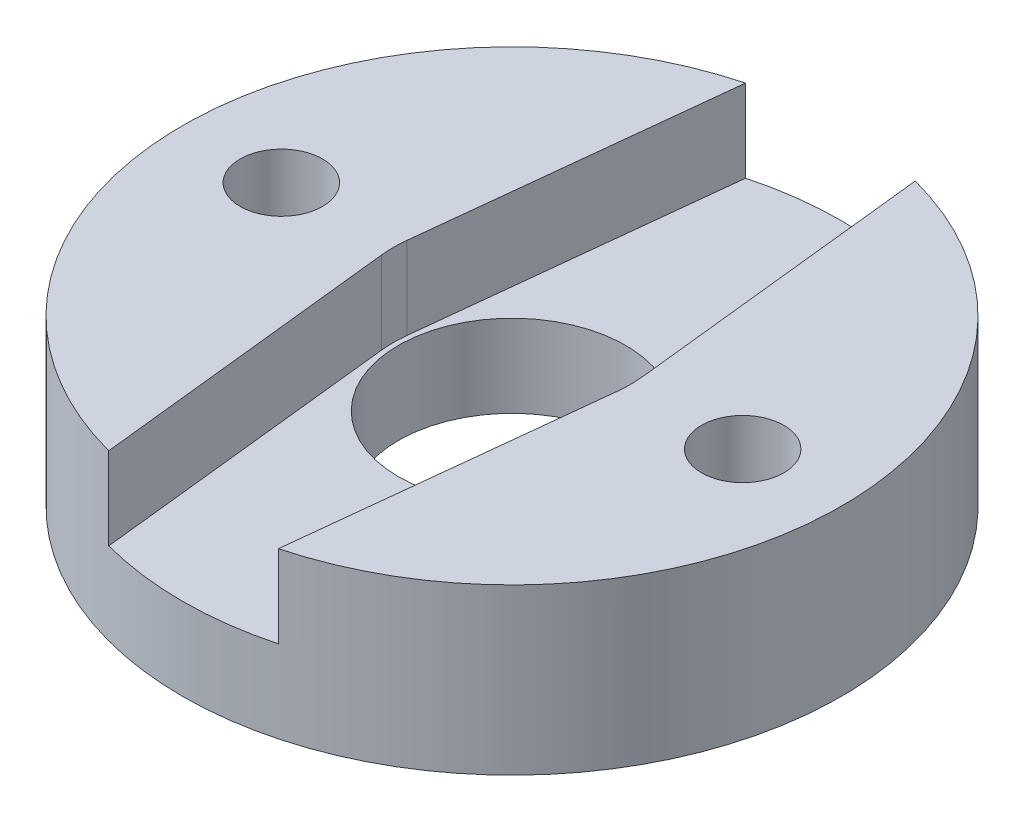
ISO-10303-21;
HEADER;
FILE_DESCRIPTION(('STEP AP214'),'2;1');
FILE_NAME('part.step','',(''),(''),'','','');
FILE_SCHEMA(('AUTOMOTIVE_DESIGN { 1 0 10303 214 1 1 1 1 }'));
ENDSEC;
DATA;
#1=APPLICATION_CONTEXT('core data for automotive mechanical design processes');
#2=APPLICATION_PROTOCOL_DEFINITION('international standard','automotive_design',2000,#1);
#3=PRODUCT_CONTEXT('',#1,'mechanical');
#4=PRODUCT('Part','Part','',(#3));
#5=PRODUCT_RELATED_PRODUCT_CATEGORY('part','',(#4));
#6=PRODUCT_DEFINITION_FORMATION('','',#4);
#7=PRODUCT_DEFINITION_CONTEXT('part definition',#1,'design');
#8=PRODUCT_DEFINITION('design','',#6,#7);
#9=PRODUCT_DEFINITION_SHAPE('','',#8);
#10=(LENGTH_UNIT() NAMED_UNIT(*) SI_UNIT(.MILLI.,.METRE.));
#11=(NAMED_UNIT(*) PLANE_ANGLE_UNIT() SI_UNIT($,.RADIAN.));
#12=(NAMED_UNIT(*) SI_UNIT($,.STERADIAN.) SOLID_ANGLE_UNIT());
#13=UNCERTAINTY_MEASURE_WITH_UNIT(LENGTH_MEASURE(1.E-05),#10,'distance_accuracy_value','');
#14=(GEOMETRIC_REPRESENTATION_CONTEXT(3) GLOBAL_UNCERTAINTY_ASSIGNED_CONTEXT((#13)) GLOBAL_UNIT_ASSIGNED_CONTEXT((#10,
#11,#12)) REPRESENTATION_CONTEXT('',''));
#15=CARTESIAN_POINT('',(0.,0.,0.));
#16=DIRECTION('',(0.,0.,1.));
#17=DIRECTION('',(1.,0.,0.));
#18=AXIS2_PLACEMENT_3D('',#15,#16,#17);
#19=CARTESIAN_POINT('',(0.,5.,0.));
#20=DIRECTION('',(0.,-1.,0.));
#21=DIRECTION('',(0.,0.,-1.));
#22=AXIS2_PLACEMENT_3D('',#19,#20,#21);
#23=CYLINDRICAL_SURFACE('',#22,10.);
#24=CARTESIAN_POINT('',(0.,0.,0.));
#25=DIRECTION('',(0.,1.,0.));
#26=DIRECTION('',(0.,0.,1.));
#27=AXIS2_PLACEMENT_3D('',#24,#25,#26);
#28=CIRCLE('',#27,10.);
#29=CARTESIAN_POINT('',(0.,0.,10.));
#30=VERTEX_POINT('',#29);
#31=EDGE_CURVE('E170',#30,#30,#28,.T.);
#32=ORIENTED_EDGE('',*,*,#31,.T.);
#33=EDGE_LOOP('',(#32));
#34=FACE_BOUND('',#33,.T.);
#35=DIRECTION('',(0.,-1.,0.));
#36=VECTOR('',#35,1.);
#37=CARTESIAN_POINT('',(-2.57381899329224,5.,-9.66309762911294));
#38=LINE('',#37,#36);
#39=CARTESIAN_POINT('',(-2.57381899329224,2.5,-9.66309762911294));
#40=VERTEX_POINT('',#39);
#41=CARTESIAN_POINT('',(-2.57381899329224,5.,-9.66309762911294));
#42=VERTEX_POINT('',#41);
#43=EDGE_CURVE('E149',#40,#42,#38,.F.);
#44=ORIENTED_EDGE('',*,*,#43,.F.);
#45=CARTESIAN_POINT('',(0.,2.5,0.));
#46=DIRECTION('',(0.,1.,0.));
#47=DIRECTION('',(0.,0.,1.));
#48=AXIS2_PLACEMENT_3D('',#45,#46,#47);
#49=CIRCLE('',#48,10.);
#50=CARTESIAN_POINT('',(2.57381899329237,2.5,-9.6630976291129));
#51=VERTEX_POINT('',#50);
#52=EDGE_CURVE('E147',#51,#40,#49,.T.);
#53=ORIENTED_EDGE('',*,*,#52,.F.);
#54=DIRECTION('',(0.,-1.,0.));
#55=VECTOR('',#54,1.);
#56=CARTESIAN_POINT('',(2.57381899329238,5.,-9.6630976291129));
#57=LINE('',#56,#55);
#58=CARTESIAN_POINT('',(2.57381899329237,5.,-9.6630976291129));
#59=VERTEX_POINT('',#58);
#60=EDGE_CURVE('E57',#51,#59,#57,.F.);
#61=ORIENTED_EDGE('',*,*,#60,.T.);
#62=CARTESIAN_POINT('',(0.,5.,0.));
#63=DIRECTION('',(0.,1.,0.));
#64=DIRECTION('',(0.,0.,1.));
#65=AXIS2_PLACEMENT_3D('',#62,#63,#64);
#66=CIRCLE('',#65,10.);
#67=CARTESIAN_POINT('',(2.57381899329231,5.,9.66309762911292));
#68=VERTEX_POINT('',#67);
#69=EDGE_CURVE('E11',#68,#59,#66,.T.);
#70=ORIENTED_EDGE('',*,*,#69,.F.);
#71=DIRECTION('',(0.,-1.,0.));
#72=VECTOR('',#71,1.);
#73=CARTESIAN_POINT('',(2.57381899329231,5.,9.66309762911292));
#74=LINE('',#73,#72);
#75=CARTESIAN_POINT('',(2.57381899329231,2.5,9.66309762911292));
#76=VERTEX_POINT('',#75);
#77=EDGE_CURVE('E154',#76,#68,#74,.F.);
#78=ORIENTED_EDGE('',*,*,#77,.F.);
#79=CARTESIAN_POINT('',(-2.57381899329231,2.5,9.66309762911292));
#80=VERTEX_POINT('',#79);
#81=EDGE_CURVE('E145',#80,#76,#49,.T.);
#82=ORIENTED_EDGE('',*,*,#81,.F.);
#83=DIRECTION('',(0.,-1.,0.));
#84=VECTOR('',#83,1.);
#85=CARTESIAN_POINT('',(-2.57381899329231,5.,9.66309762911292));
#86=LINE('',#85,#84);
#87=CARTESIAN_POINT('',(-2.57381899329231,5.,9.66309762911292));
#88=VERTEX_POINT('',#87);
#89=EDGE_CURVE('E151',#80,#88,#86,.F.);
#90=ORIENTED_EDGE('',*,*,#89,.T.);
#91=EDGE_CURVE('E41',#42,#88,#66,.T.);
#92=ORIENTED_EDGE('',*,*,#91,.F.);
#93=EDGE_LOOP('',(#44,#53,#61,#70,#78,#82,#90,#92));
#94=FACE_BOUND('',#93,.T.);
#95=ADVANCED_FACE('F33',(#34,#94),#23,.T.);
#96=CARTESIAN_POINT('',(0.,5.,0.));
#97=DIRECTION('',(0.,1.,0.));
#98=DIRECTION('',(0.,0.,1.));
#99=AXIS2_PLACEMENT_3D('',#96,#97,#98);
#100=PLANE('',#99);
#101=CARTESIAN_POINT('',(7.,5.,0.));
#102=DIRECTION('',(0.,1.,0.));
#103=DIRECTION('',(0.,0.,1.));
#104=AXIS2_PLACEMENT_3D('',#101,#102,#103);
#105=CIRCLE('',#104,1.25);
#106=CARTESIAN_POINT('',(7.,5.,1.25));
#107=VERTEX_POINT('',#106);
#108=EDGE_CURVE('E165',#107,#107,#105,.T.);
#109=ORIENTED_EDGE('',*,*,#108,.F.);
#110=EDGE_LOOP('',(#109));
#111=FACE_BOUND('',#110,.T.);
#112=CARTESIAN_POINT('',(0.,5.,0.));
#113=DIRECTION('',(0.,1.,0.));
#114=DIRECTION('',(0.,0.,1.));
#115=AXIS2_PLACEMENT_3D('',#112,#113,#114);
#116=CIRCLE('',#115,3.6);
#117=CARTESIAN_POINT('',(3.57904224953043,5.,0.387887323943661));
#118=VERTEX_POINT('',#117);
#119=CARTESIAN_POINT('',(3.57904224953043,5.,-0.387887323943636));
#120=VERTEX_POINT('',#119);
#121=EDGE_CURVE('E49',#118,#120,#116,.T.);
#122=ORIENTED_EDGE('',*,*,#121,.F.);
#123=DIRECTION('',(-0.107746478873239,0.,0.994178402647341));
#124=VECTOR('',#123,1.);
#125=CARTESIAN_POINT('',(3.57904224953043,5.,0.387887323943661));
#126=LINE('',#125,#124);
#127=EDGE_CURVE('E115',#118,#68,#126,.T.);
#128=ORIENTED_EDGE('',*,*,#127,.T.);
#129=ORIENTED_EDGE('',*,*,#69,.T.);
#130=DIRECTION('',(-0.107746478873233,0.,-0.994178402647342));
#131=VECTOR('',#130,1.);
#132=CARTESIAN_POINT('',(3.57904224953043,5.,-0.387887323943636));
#133=LINE('',#132,#131);
#134=EDGE_CURVE('E131',#120,#59,#133,.T.);
#135=ORIENTED_EDGE('',*,*,#134,.F.);
#136=EDGE_LOOP('',(#122,#128,#129,#135));
#137=FACE_BOUND('',#136,.T.);
#138=ADVANCED_FACE('F206',(#111,#137),#100,.T.);
#139=CARTESIAN_POINT('',(0.,5.,0.));
#140=DIRECTION('',(0.,1.,0.));
#141=DIRECTION('',(0.,0.,1.));
#142=AXIS2_PLACEMENT_3D('',#139,#140,#141);
#143=CYLINDRICAL_SURFACE('',#142,3.449999958);
#144=CARTESIAN_POINT('',(0.,0.,0.));
#145=DIRECTION('',(0.,1.,0.));
#146=DIRECTION('',(0.,0.,1.));
#147=AXIS2_PLACEMENT_3D('',#144,#145,#146);
#148=CIRCLE('',#147,3.449999958);
#149=CARTESIAN_POINT('',(0.,0.,3.449999958));
#150=VERTEX_POINT('',#149);
#151=EDGE_CURVE('E156',#150,#150,#148,.T.);
#152=ORIENTED_EDGE('',*,*,#151,.F.);
#153=EDGE_LOOP('',(#152));
#154=FACE_BOUND('',#153,.T.);
#155=CARTESIAN_POINT('',(0.,2.5,0.));
#156=DIRECTION('',(0.,1.,0.));
#157=DIRECTION('',(0.,0.,1.));
#158=AXIS2_PLACEMENT_3D('',#155,#156,#157);
#159=CIRCLE('',#158,3.449999958);
#160=CARTESIAN_POINT('',(0.,2.5,3.449999958));
#161=VERTEX_POINT('',#160);
#162=EDGE_CURVE('E36',#161,#161,#159,.F.);
#163=ORIENTED_EDGE('',*,*,#162,.F.);
#164=EDGE_LOOP('',(#163));
#165=FACE_BOUND('',#164,.T.);
#166=ADVANCED_FACE('F210',(#154,#165),#143,.F.);
#167=DIRECTION('',(0.107746478873239,0.,0.994178402647341));
#168=VECTOR('',#167,1.);
#169=CARTESIAN_POINT('',(-3.57904224953043,5.,0.387887323943661));
#170=LINE('',#169,#168);
#171=CARTESIAN_POINT('',(-3.57904224953043,5.,0.387887323943661));
#172=VERTEX_POINT('',#171);
#173=EDGE_CURVE('E118',#172,#88,#170,.T.);
#174=ORIENTED_EDGE('',*,*,#173,.F.);
#175=CARTESIAN_POINT('',(0.,5.,0.));
#176=DIRECTION('',(0.,1.,0.));
#177=DIRECTION('',(0.,0.,1.));
#178=AXIS2_PLACEMENT_3D('',#175,#176,#177);
#179=CIRCLE('',#178,3.6);
#180=CARTESIAN_POINT('',(-3.57904224953043,5.,-0.387887323943687));
#181=VERTEX_POINT('',#180);
#182=EDGE_CURVE('E136',#181,#172,#179,.T.);
#183=ORIENTED_EDGE('',*,*,#182,.F.);
#184=DIRECTION('',(0.107746478873246,0.,-0.99417840264734));
#185=VECTOR('',#184,1.);
#186=CARTESIAN_POINT('',(-3.57904224953043,5.,-0.387887323943686));
#187=LINE('',#186,#185);
#188=EDGE_CURVE('E133',#181,#42,#187,.T.);
#189=ORIENTED_EDGE('',*,*,#188,.T.);
#190=ORIENTED_EDGE('',*,*,#91,.T.);
#191=EDGE_LOOP('',(#174,#183,#189,#190));
#192=FACE_BOUND('',#191,.T.);
#193=CARTESIAN_POINT('',(-7.,5.,0.));
#194=DIRECTION('',(0.,1.,0.));
#195=DIRECTION('',(0.,0.,1.));
#196=AXIS2_PLACEMENT_3D('',#193,#194,#195);
#197=CIRCLE('',#196,1.25);
#198=CARTESIAN_POINT('',(-7.,5.,1.25));
#199=VERTEX_POINT('',#198);
#200=EDGE_CURVE('E159',#199,#199,#197,.T.);
#201=ORIENTED_EDGE('',*,*,#200,.F.);
#202=EDGE_LOOP('',(#201));
#203=FACE_BOUND('',#202,.T.);
#204=ADVANCED_FACE('F178',(#192,#203),#100,.T.);
#205=CARTESIAN_POINT('',(0.,0.,0.));
#206=DIRECTION('',(0.,1.,0.));
#207=DIRECTION('',(0.,0.,1.));
#208=AXIS2_PLACEMENT_3D('',#205,#206,#207);
#209=PLANE('',#208);
#210=ORIENTED_EDGE('',*,*,#151,.T.);
#211=EDGE_LOOP('',(#210));
#212=FACE_BOUND('',#211,.T.);
#213=CARTESIAN_POINT('',(-7.,0.,0.));
#214=DIRECTION('',(0.,1.,0.));
#215=DIRECTION('',(0.,0.,1.));
#216=AXIS2_PLACEMENT_3D('',#213,#214,#215);
#217=CIRCLE('',#216,1.24999999999999);
#218=CARTESIAN_POINT('',(-7.,0.,1.24999999999999));
#219=VERTEX_POINT('',#218);
#220=EDGE_CURVE('E162',#219,#219,#217,.T.);
#221=ORIENTED_EDGE('',*,*,#220,.T.);
#222=EDGE_LOOP('',(#221));
#223=FACE_BOUND('',#222,.T.);
#224=CARTESIAN_POINT('',(7.,0.,0.));
#225=DIRECTION('',(0.,1.,0.));
#226=DIRECTION('',(0.,0.,1.));
#227=AXIS2_PLACEMENT_3D('',#224,#225,#226);
#228=CIRCLE('',#227,1.24999999999999);
#229=CARTESIAN_POINT('',(7.,0.,1.24999999999999));
#230=VERTEX_POINT('',#229);
#231=EDGE_CURVE('E168',#230,#230,#228,.T.);
#232=ORIENTED_EDGE('',*,*,#231,.T.);
#233=EDGE_LOOP('',(#232));
#234=FACE_BOUND('',#233,.T.);
#235=ORIENTED_EDGE('',*,*,#31,.F.);
#236=EDGE_LOOP('',(#235));
#237=FACE_BOUND('',#236,.T.);
#238=ADVANCED_FACE('F222',(#212,#223,#234,#237),#209,.F.);
#239=CARTESIAN_POINT('',(7.,5.,0.));
#240=DIRECTION('',(0.,1.,0.));
#241=DIRECTION('',(0.,0.,1.));
#242=AXIS2_PLACEMENT_3D('',#239,#240,#241);
#243=CYLINDRICAL_SURFACE('',#242,1.24999999999999);
#244=ORIENTED_EDGE('',*,*,#108,.T.);
#245=EDGE_LOOP('',(#244));
#246=FACE_BOUND('',#245,.T.);
#247=ORIENTED_EDGE('',*,*,#231,.F.);
#248=EDGE_LOOP('',(#247));
#249=FACE_BOUND('',#248,.T.);
#250=ADVANCED_FACE('F226',(#246,#249),#243,.F.);
#251=CARTESIAN_POINT('',(-7.,5.,0.));
#252=DIRECTION('',(0.,1.,0.));
#253=DIRECTION('',(0.,0.,1.));
#254=AXIS2_PLACEMENT_3D('',#251,#252,#253);
#255=CYLINDRICAL_SURFACE('',#254,1.24999999999999);
#256=ORIENTED_EDGE('',*,*,#200,.T.);
#257=EDGE_LOOP('',(#256));
#258=FACE_BOUND('',#257,.T.);
#259=ORIENTED_EDGE('',*,*,#220,.F.);
#260=EDGE_LOOP('',(#259));
#261=FACE_BOUND('',#260,.T.);
#262=ADVANCED_FACE('F231',(#258,#261),#255,.F.);
#263=CARTESIAN_POINT('',(3.57904224953043,2.5,0.387887323943661));
#264=DIRECTION('',(-0.994178402647341,0.,-0.107746478873239));
#265=DIRECTION('',(-0.107746478873239,0.,0.994178402647341));
#266=AXIS2_PLACEMENT_3D('',#263,#264,#265);
#267=PLANE('',#266);
#268=ORIENTED_EDGE('',*,*,#77,.T.);
#269=ORIENTED_EDGE('',*,*,#127,.F.);
#270=DIRECTION('',(0.,1.,0.));
#271=VECTOR('',#270,1.);
#272=CARTESIAN_POINT('',(3.57904224953043,2.5,0.387887323943661));
#273=LINE('',#272,#271);
#274=CARTESIAN_POINT('',(3.57904224953043,2.5,0.387887323943661));
#275=VERTEX_POINT('',#274);
#276=EDGE_CURVE('E140',#275,#118,#273,.T.);
#277=ORIENTED_EDGE('',*,*,#276,.F.);
#278=DIRECTION('',(-0.107746478873239,0.,0.994178402647341));
#279=VECTOR('',#278,1.);
#280=CARTESIAN_POINT('',(3.57904224953043,2.5,0.387887323943661));
#281=LINE('',#280,#279);
#282=EDGE_CURVE('E104',#275,#76,#281,.T.);
#283=ORIENTED_EDGE('',*,*,#282,.T.);
#284=EDGE_LOOP('',(#268,#269,#277,#283));
#285=FACE_BOUND('',#284,.T.);
#286=ADVANCED_FACE('F202',(#285),#267,.T.);
#287=CARTESIAN_POINT('',(-3.57904224953043,2.5,0.387887323943661));
#288=DIRECTION('',(-0.994178402647341,0.,0.107746478873239));
#289=DIRECTION('',(0.107746478873239,0.,0.994178402647341));
#290=AXIS2_PLACEMENT_3D('',#287,#288,#289);
#291=PLANE('',#290);
#292=DIRECTION('',(0.107746478873239,0.,0.994178402647341));
#293=VECTOR('',#292,1.);
#294=CARTESIAN_POINT('',(-3.57904224953043,2.5,0.387887323943661));
#295=LINE('',#294,#293);
#296=CARTESIAN_POINT('',(-3.57904224953043,2.5,0.387887323943661));
#297=VERTEX_POINT('',#296);
#298=EDGE_CURVE('E126',#297,#80,#295,.T.);
#299=ORIENTED_EDGE('',*,*,#298,.F.);
#300=DIRECTION('',(0.,1.,0.));
#301=VECTOR('',#300,1.);
#302=CARTESIAN_POINT('',(-3.57904224953043,2.5,0.387887323943661));
#303=LINE('',#302,#301);
#304=EDGE_CURVE('E142',#297,#172,#303,.T.);
#305=ORIENTED_EDGE('',*,*,#304,.T.);
#306=ORIENTED_EDGE('',*,*,#173,.T.);
#307=ORIENTED_EDGE('',*,*,#89,.F.);
#308=EDGE_LOOP('',(#299,#305,#306,#307));
#309=FACE_BOUND('',#308,.T.);
#310=ADVANCED_FACE('F188',(#309),#291,.F.);
#311=CARTESIAN_POINT('',(-3.57904224953043,2.5,-0.387887323943686));
#312=DIRECTION('',(0.99417840264734,0.,0.107746478873246));
#313=DIRECTION('',(0.107746478873246,0.,-0.99417840264734));
#314=AXIS2_PLACEMENT_3D('',#311,#312,#313);
#315=PLANE('',#314);
#316=ORIENTED_EDGE('',*,*,#43,.T.);
#317=ORIENTED_EDGE('',*,*,#188,.F.);
#318=DIRECTION('',(0.,1.,0.));
#319=VECTOR('',#318,1.);
#320=CARTESIAN_POINT('',(-3.57904224953043,2.5,-0.387887323943687));
#321=LINE('',#320,#319);
#322=CARTESIAN_POINT('',(-3.57904224953043,2.5,-0.387887323943687));
#323=VERTEX_POINT('',#322);
#324=EDGE_CURVE('E103',#323,#181,#321,.T.);
#325=ORIENTED_EDGE('',*,*,#324,.F.);
#326=DIRECTION('',(0.107746478873246,0.,-0.99417840264734));
#327=VECTOR('',#326,1.);
#328=CARTESIAN_POINT('',(-3.57904224953043,2.5,-0.387887323943686));
#329=LINE('',#328,#327);
#330=EDGE_CURVE('E110',#323,#40,#329,.T.);
#331=ORIENTED_EDGE('',*,*,#330,.T.);
#332=EDGE_LOOP('',(#316,#317,#325,#331));
#333=FACE_BOUND('',#332,.T.);
#334=ADVANCED_FACE('F194',(#333),#315,.T.);
#335=CARTESIAN_POINT('',(3.57904224953043,2.5,-0.387887323943636));
#336=DIRECTION('',(0.994178402647342,0.,-0.107746478873233));
#337=DIRECTION('',(-0.107746478873233,0.,-0.994178402647342));
#338=AXIS2_PLACEMENT_3D('',#335,#336,#337);
#339=PLANE('',#338);
#340=DIRECTION('',(-0.107746478873233,0.,-0.994178402647342));
#341=VECTOR('',#340,1.);
#342=CARTESIAN_POINT('',(3.57904224953043,2.5,-0.387887323943636));
#343=LINE('',#342,#341);
#344=CARTESIAN_POINT('',(3.57904224953043,2.5,-0.387887323943636));
#345=VERTEX_POINT('',#344);
#346=EDGE_CURVE('E106',#345,#51,#343,.T.);
#347=ORIENTED_EDGE('',*,*,#346,.F.);
#348=DIRECTION('',(0.,1.,0.));
#349=VECTOR('',#348,1.);
#350=CARTESIAN_POINT('',(3.57904224953043,2.5,-0.387887323943636));
#351=LINE('',#350,#349);
#352=EDGE_CURVE('E98',#345,#120,#351,.T.);
#353=ORIENTED_EDGE('',*,*,#352,.T.);
#354=ORIENTED_EDGE('',*,*,#134,.T.);
#355=ORIENTED_EDGE('',*,*,#60,.F.);
#356=EDGE_LOOP('',(#347,#353,#354,#355));
#357=FACE_BOUND('',#356,.T.);
#358=ADVANCED_FACE('F107',(#357),#339,.F.);
#359=CARTESIAN_POINT('',(0.,2.5,0.));
#360=DIRECTION('',(0.,1.,0.));
#361=DIRECTION('',(0.,0.,1.));
#362=AXIS2_PLACEMENT_3D('',#359,#360,#361);
#363=PLANE('',#362);
#364=ORIENTED_EDGE('',*,*,#162,.T.);
#365=EDGE_LOOP('',(#364));
#366=FACE_BOUND('',#365,.T.);
#367=ORIENTED_EDGE('',*,*,#52,.T.);
#368=ORIENTED_EDGE('',*,*,#330,.F.);
#369=CARTESIAN_POINT('',(0.,2.5,0.));
#370=DIRECTION('',(0.,1.,0.));
#371=DIRECTION('',(0.,0.,1.));
#372=AXIS2_PLACEMENT_3D('',#369,#370,#371);
#373=CIRCLE('',#372,3.6);
#374=EDGE_CURVE('E123',#323,#297,#373,.T.);
#375=ORIENTED_EDGE('',*,*,#374,.T.);
#376=ORIENTED_EDGE('',*,*,#298,.T.);
#377=ORIENTED_EDGE('',*,*,#81,.T.);
#378=ORIENTED_EDGE('',*,*,#282,.F.);
#379=CARTESIAN_POINT('',(0.,2.5,0.));
#380=DIRECTION('',(0.,1.,0.));
#381=DIRECTION('',(0.,0.,1.));
#382=AXIS2_PLACEMENT_3D('',#379,#380,#381);
#383=CIRCLE('',#382,3.6);
#384=EDGE_CURVE('E101',#275,#345,#383,.T.);
#385=ORIENTED_EDGE('',*,*,#384,.T.);
#386=ORIENTED_EDGE('',*,*,#346,.T.);
#387=EDGE_LOOP('',(#367,#368,#375,#376,#377,#378,#385,#386));
#388=FACE_BOUND('',#387,.T.);
#389=ADVANCED_FACE('F113',(#366,#388),#363,.T.);
#390=CARTESIAN_POINT('',(0.,2.5,0.));
#391=DIRECTION('',(0.,1.,0.));
#392=DIRECTION('',(0.,0.,1.));
#393=AXIS2_PLACEMENT_3D('',#390,#391,#392);
#394=CYLINDRICAL_SURFACE('',#393,3.6);
#395=ORIENTED_EDGE('',*,*,#121,.T.);
#396=ORIENTED_EDGE('',*,*,#352,.F.);
#397=ORIENTED_EDGE('',*,*,#384,.F.);
#398=ORIENTED_EDGE('',*,*,#276,.T.);
#399=EDGE_LOOP('',(#395,#396,#397,#398));
#400=FACE_BOUND('',#399,.T.);
#401=ADVANCED_FACE('F99',(#400),#394,.F.);
#402=CARTESIAN_POINT('',(0.,2.5,0.));
#403=DIRECTION('',(0.,1.,0.));
#404=DIRECTION('',(0.,0.,1.));
#405=AXIS2_PLACEMENT_3D('',#402,#403,#404);
#406=CYLINDRICAL_SURFACE('',#405,3.6);
#407=ORIENTED_EDGE('',*,*,#182,.T.);
#408=ORIENTED_EDGE('',*,*,#304,.F.);
#409=ORIENTED_EDGE('',*,*,#374,.F.);
#410=ORIENTED_EDGE('',*,*,#324,.T.);
#411=EDGE_LOOP('',(#407,#408,#409,#410));
#412=FACE_BOUND('',#411,.T.);
#413=ADVANCED_FACE('F192',(#412),#406,.F.);
#414=CLOSED_SHELL('',(#95,#138,#166,#204,#238,#250,#262,#286,#310,#334,#358,#389,#401,#413));
#415=MANIFOLD_SOLID_BREP('B2',#414);
#416=ADVANCED_BREP_SHAPE_REPRESENTATION('',(#18,#415),#14);
#417=SHAPE_DEFINITION_REPRESENTATION(#9,#416);
ENDSEC;
END-ISO-10303-21;
